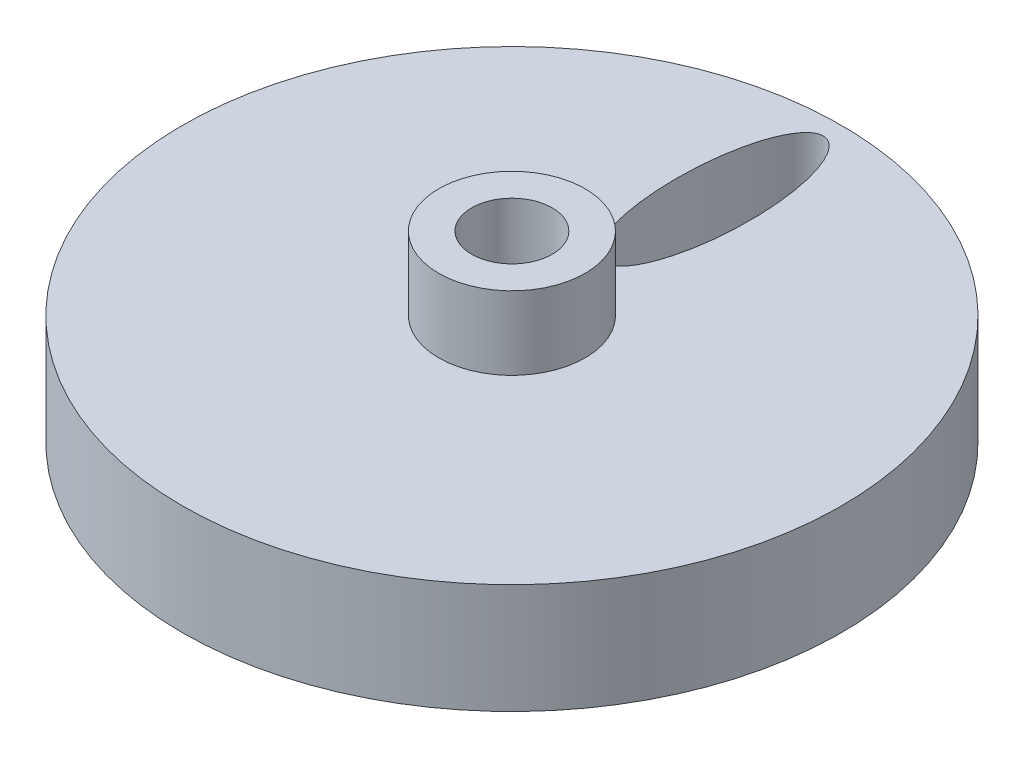
ISO-10303-21;
HEADER;
FILE_DESCRIPTION(('STEP AP214'),'2;1');
FILE_NAME('part.step','',(''),(''),'','','');
FILE_SCHEMA(('AUTOMOTIVE_DESIGN { 1 0 10303 214 1 1 1 1 }'));
ENDSEC;
DATA;
#1=APPLICATION_CONTEXT('core data for automotive mechanical design processes');
#2=APPLICATION_PROTOCOL_DEFINITION('international standard','automotive_design',2000,#1);
#3=PRODUCT_CONTEXT('',#1,'mechanical');
#4=PRODUCT('Part','Part','',(#3));
#5=PRODUCT_RELATED_PRODUCT_CATEGORY('part','',(#4));
#6=PRODUCT_DEFINITION_FORMATION('','',#4);
#7=PRODUCT_DEFINITION_CONTEXT('part definition',#1,'design');
#8=PRODUCT_DEFINITION('design','',#6,#7);
#9=PRODUCT_DEFINITION_SHAPE('','',#8);
#10=(LENGTH_UNIT() NAMED_UNIT(*) SI_UNIT(.MILLI.,.METRE.));
#11=(NAMED_UNIT(*) PLANE_ANGLE_UNIT() SI_UNIT($,.RADIAN.));
#12=(NAMED_UNIT(*) SI_UNIT($,.STERADIAN.) SOLID_ANGLE_UNIT());
#13=UNCERTAINTY_MEASURE_WITH_UNIT(LENGTH_MEASURE(1.E-05),#10,'distance_accuracy_value','');
#14=(GEOMETRIC_REPRESENTATION_CONTEXT(3) GLOBAL_UNCERTAINTY_ASSIGNED_CONTEXT((#13)) GLOBAL_UNIT_ASSIGNED_CONTEXT((#10,
#11,#12)) REPRESENTATION_CONTEXT('',''));
#15=CARTESIAN_POINT('',(0.,0.,0.));
#16=DIRECTION('',(0.,0.,1.));
#17=DIRECTION('',(1.,0.,0.));
#18=AXIS2_PLACEMENT_3D('',#15,#16,#17);
#19=CARTESIAN_POINT('',(0.,3.,0.));
#20=DIRECTION('',(0.,-1.,0.));
#21=DIRECTION('',(0.,0.,-1.));
#22=AXIS2_PLACEMENT_3D('',#19,#20,#21);
#23=CYLINDRICAL_SURFACE('',#22,9.);
#24=CARTESIAN_POINT('',(0.,3.,0.));
#25=DIRECTION('',(0.,1.,0.));
#26=DIRECTION('',(0.,0.,1.));
#27=AXIS2_PLACEMENT_3D('',#24,#25,#26);
#28=CIRCLE('',#27,9.);
#29=CARTESIAN_POINT('',(0.,3.,9.));
#30=VERTEX_POINT('',#29);
#31=EDGE_CURVE('E45',#30,#30,#28,.T.);
#32=ORIENTED_EDGE('',*,*,#31,.F.);
#33=EDGE_LOOP('',(#32));
#34=FACE_BOUND('',#33,.T.);
#35=CARTESIAN_POINT('',(0.,0.,0.));
#36=DIRECTION('',(0.,1.,0.));
#37=DIRECTION('',(0.,0.,1.));
#38=AXIS2_PLACEMENT_3D('',#35,#36,#37);
#39=CIRCLE('',#38,9.);
#40=CARTESIAN_POINT('',(0.,0.,9.));
#41=VERTEX_POINT('',#40);
#42=EDGE_CURVE('E40',#41,#41,#39,.T.);
#43=ORIENTED_EDGE('',*,*,#42,.T.);
#44=EDGE_LOOP('',(#43));
#45=FACE_BOUND('',#44,.T.);
#46=ADVANCED_FACE('F37',(#34,#45),#23,.T.);
#47=CARTESIAN_POINT('',(0.,3.,0.));
#48=DIRECTION('',(0.,1.,0.));
#49=DIRECTION('',(0.,0.,1.));
#50=AXIS2_PLACEMENT_3D('',#47,#48,#49);
#51=PLANE('',#50);
#52=CARTESIAN_POINT('',(0.,3.,-5.49925853005953));
#53=DIRECTION('',(0.,1.,0.));
#54=DIRECTION('',(0.,0.,1.));
#55=AXIS2_PLACEMENT_3D('',#52,#53,#54);
#56=ELLIPSE('',#55,3.,1.);
#57=CARTESIAN_POINT('',(0.,3.,-2.49925853005953));
#58=VERTEX_POINT('',#57);
#59=EDGE_CURVE('E65',#58,#58,#56,.T.);
#60=ORIENTED_EDGE('',*,*,#59,.F.);
#61=EDGE_LOOP('',(#60));
#62=FACE_BOUND('',#61,.T.);
#63=CARTESIAN_POINT('',(0.,3.,0.));
#64=DIRECTION('',(0.,1.,0.));
#65=DIRECTION('',(0.,0.,1.));
#66=AXIS2_PLACEMENT_3D('',#63,#64,#65);
#67=CIRCLE('',#66,2.);
#68=CARTESIAN_POINT('',(0.,3.,2.));
#69=VERTEX_POINT('',#68);
#70=EDGE_CURVE('E10',#69,#69,#67,.T.);
#71=ORIENTED_EDGE('',*,*,#70,.F.);
#72=EDGE_LOOP('',(#71));
#73=FACE_BOUND('',#72,.T.);
#74=ORIENTED_EDGE('',*,*,#31,.T.);
#75=EDGE_LOOP('',(#74));
#76=FACE_BOUND('',#75,.T.);
#77=ADVANCED_FACE('F94',(#62,#73,#76),#51,.T.);
#78=CARTESIAN_POINT('',(0.,0.,0.));
#79=DIRECTION('',(0.,1.,0.));
#80=DIRECTION('',(0.,0.,1.));
#81=AXIS2_PLACEMENT_3D('',#78,#79,#80);
#82=PLANE('',#81);
#83=CARTESIAN_POINT('',(0.,0.,-5.49925853005953));
#84=DIRECTION('',(0.,1.,0.));
#85=DIRECTION('',(0.,0.,1.));
#86=AXIS2_PLACEMENT_3D('',#83,#84,#85);
#87=ELLIPSE('',#86,3.,1.);
#88=CARTESIAN_POINT('',(0.,0.,-2.49925853005953));
#89=VERTEX_POINT('',#88);
#90=EDGE_CURVE('E61',#89,#89,#87,.T.);
#91=ORIENTED_EDGE('',*,*,#90,.T.);
#92=EDGE_LOOP('',(#91));
#93=FACE_BOUND('',#92,.T.);
#94=ORIENTED_EDGE('',*,*,#42,.F.);
#95=EDGE_LOOP('',(#94));
#96=FACE_BOUND('',#95,.T.);
#97=ADVANCED_FACE('F92',(#93,#96),#82,.F.);
#98=CARTESIAN_POINT('',(0.,5.,0.));
#99=DIRECTION('',(0.,-1.,0.));
#100=DIRECTION('',(0.,0.,-1.));
#101=AXIS2_PLACEMENT_3D('',#98,#99,#100);
#102=CYLINDRICAL_SURFACE('',#101,2.);
#103=CARTESIAN_POINT('',(0.,5.,0.));
#104=DIRECTION('',(0.,1.,0.));
#105=DIRECTION('',(0.,0.,1.));
#106=AXIS2_PLACEMENT_3D('',#103,#104,#105);
#107=CIRCLE('',#106,2.);
#108=CARTESIAN_POINT('',(0.,5.,2.));
#109=VERTEX_POINT('',#108);
#110=EDGE_CURVE('E52',#109,#109,#107,.T.);
#111=ORIENTED_EDGE('',*,*,#110,.F.);
#112=EDGE_LOOP('',(#111));
#113=FACE_BOUND('',#112,.T.);
#114=ORIENTED_EDGE('',*,*,#70,.T.);
#115=EDGE_LOOP('',(#114));
#116=FACE_BOUND('',#115,.T.);
#117=ADVANCED_FACE('F88',(#113,#116),#102,.T.);
#118=CARTESIAN_POINT('',(0.,5.,0.));
#119=DIRECTION('',(0.,1.,0.));
#120=DIRECTION('',(0.,0.,1.));
#121=AXIS2_PLACEMENT_3D('',#118,#119,#120);
#122=PLANE('',#121);
#123=CARTESIAN_POINT('',(0.,5.,0.));
#124=DIRECTION('',(0.,1.,0.));
#125=DIRECTION('',(0.,0.,1.));
#126=AXIS2_PLACEMENT_3D('',#123,#124,#125);
#127=CIRCLE('',#126,1.1);
#128=CARTESIAN_POINT('',(0.,5.,1.1));
#129=VERTEX_POINT('',#128);
#130=EDGE_CURVE('E57',#129,#129,#127,.T.);
#131=ORIENTED_EDGE('',*,*,#130,.F.);
#132=EDGE_LOOP('',(#131));
#133=FACE_BOUND('',#132,.T.);
#134=ORIENTED_EDGE('',*,*,#110,.T.);
#135=EDGE_LOOP('',(#134));
#136=FACE_BOUND('',#135,.T.);
#137=ADVANCED_FACE('F84',(#133,#136),#122,.T.);
#138=CARTESIAN_POINT('',(0.,3.,0.));
#139=DIRECTION('',(0.,1.,0.));
#140=DIRECTION('',(0.,0.,1.));
#141=AXIS2_PLACEMENT_3D('',#138,#139,#140);
#142=CYLINDRICAL_SURFACE('',#141,1.1);
#143=CARTESIAN_POINT('',(0.,3.,0.));
#144=DIRECTION('',(0.,1.,0.));
#145=DIRECTION('',(0.,0.,1.));
#146=AXIS2_PLACEMENT_3D('',#143,#144,#145);
#147=CIRCLE('',#146,1.1);
#148=CARTESIAN_POINT('',(0.,3.,1.1));
#149=VERTEX_POINT('',#148);
#150=EDGE_CURVE('E56',#149,#149,#147,.T.);
#151=ORIENTED_EDGE('',*,*,#150,.F.);
#152=EDGE_LOOP('',(#151));
#153=FACE_BOUND('',#152,.T.);
#154=ORIENTED_EDGE('',*,*,#130,.T.);
#155=EDGE_LOOP('',(#154));
#156=FACE_BOUND('',#155,.T.);
#157=ADVANCED_FACE('F80',(#153,#156),#142,.F.);
#158=CARTESIAN_POINT('',(0.,3.,0.));
#159=DIRECTION('',(0.,1.,0.));
#160=DIRECTION('',(0.,0.,1.));
#161=AXIS2_PLACEMENT_3D('',#158,#159,#160);
#162=PLANE('',#161);
#163=ORIENTED_EDGE('',*,*,#150,.T.);
#164=EDGE_LOOP('',(#163));
#165=FACE_BOUND('',#164,.T.);
#166=ADVANCED_FACE('F76',(#165),#162,.T.);
#167=DIRECTION('',(0.,1.,0.));
#168=VECTOR('',#167,1.);
#169=SURFACE_OF_LINEAR_EXTRUSION('',#87,#168);
#170=ORIENTED_EDGE('',*,*,#90,.F.);
#171=EDGE_LOOP('',(#170));
#172=FACE_BOUND('',#171,.T.);
#173=ORIENTED_EDGE('',*,*,#59,.T.);
#174=EDGE_LOOP('',(#173));
#175=FACE_BOUND('',#174,.T.);
#176=ADVANCED_FACE('F73',(#172,#175),#169,.F.);
#177=CLOSED_SHELL('',(#46,#77,#97,#117,#137,#157,#166,#176));
#178=MANIFOLD_SOLID_BREP('B2',#177);
#179=ADVANCED_BREP_SHAPE_REPRESENTATION('',(#18,#178),#14);
#180=SHAPE_DEFINITION_REPRESENTATION(#9,#179);
ENDSEC;
END-ISO-10303-21;
